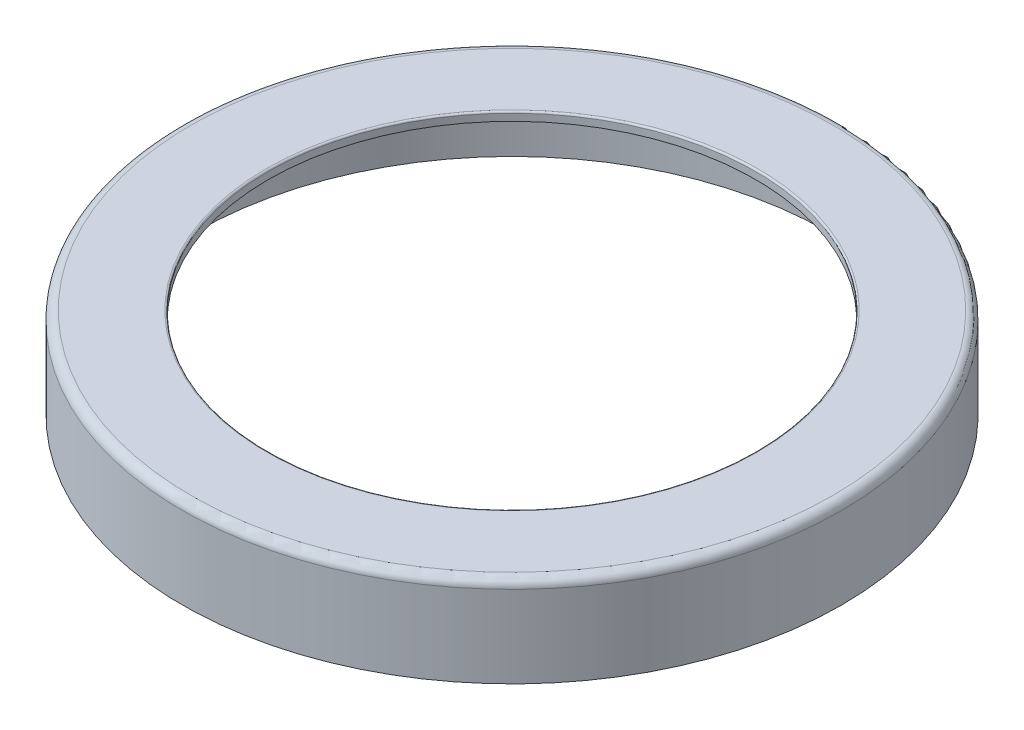
ISO-10303-21;
HEADER;
FILE_DESCRIPTION(('STEP AP214'),'2;1');
FILE_NAME('part.step','',(''),(''),'','','');
FILE_SCHEMA(('AUTOMOTIVE_DESIGN { 1 0 10303 214 1 1 1 1 }'));
ENDSEC;
DATA;
#1=APPLICATION_CONTEXT('core data for automotive mechanical design processes');
#2=APPLICATION_PROTOCOL_DEFINITION('international standard','automotive_design',2000,#1);
#3=PRODUCT_CONTEXT('',#1,'mechanical');
#4=PRODUCT('Part','Part','',(#3));
#5=PRODUCT_RELATED_PRODUCT_CATEGORY('part','',(#4));
#6=PRODUCT_DEFINITION_FORMATION('','',#4);
#7=PRODUCT_DEFINITION_CONTEXT('part definition',#1,'design');
#8=PRODUCT_DEFINITION('design','',#6,#7);
#9=PRODUCT_DEFINITION_SHAPE('','',#8);
#10=(LENGTH_UNIT() NAMED_UNIT(*) SI_UNIT(.MILLI.,.METRE.));
#11=(NAMED_UNIT(*) PLANE_ANGLE_UNIT() SI_UNIT($,.RADIAN.));
#12=(NAMED_UNIT(*) SI_UNIT($,.STERADIAN.) SOLID_ANGLE_UNIT());
#13=UNCERTAINTY_MEASURE_WITH_UNIT(LENGTH_MEASURE(1.E-05),#10,'distance_accuracy_value','');
#14=(GEOMETRIC_REPRESENTATION_CONTEXT(3) GLOBAL_UNCERTAINTY_ASSIGNED_CONTEXT((#13)) GLOBAL_UNIT_ASSIGNED_CONTEXT((#10,
#11,#12)) REPRESENTATION_CONTEXT('',''));
#15=CARTESIAN_POINT('',(0.,0.,0.));
#16=DIRECTION('',(0.,0.,1.));
#17=DIRECTION('',(1.,0.,0.));
#18=AXIS2_PLACEMENT_3D('',#15,#16,#17);
#19=CARTESIAN_POINT('',(-72.7,-1.,0.));
#20=DIRECTION('',(0.,1.,0.));
#21=DIRECTION('',(-1.,0.,0.));
#22=AXIS2_PLACEMENT_3D('',#19,#20,#21);
#23=PLANE('',#22);
#24=CARTESIAN_POINT('',(0.,-1.,0.));
#25=DIRECTION('',(0.,-1.,0.));
#26=DIRECTION('',(1.,0.,0.));
#27=AXIS2_PLACEMENT_3D('',#24,#25,#26);
#28=CIRCLE('',#27,72.7);
#29=CARTESIAN_POINT('',(72.7,-1.,0.));
#30=VERTEX_POINT('',#29);
#31=EDGE_CURVE('E10',#30,#30,#28,.T.);
#32=ORIENTED_EDGE('',*,*,#31,.F.);
#33=EDGE_LOOP('',(#32));
#34=FACE_BOUND('',#33,.T.);
#35=CARTESIAN_POINT('',(0.,-1.,0.));
#36=DIRECTION('',(0.,-1.,0.));
#37=DIRECTION('',(1.,0.,0.));
#38=AXIS2_PLACEMENT_3D('',#35,#36,#37);
#39=CIRCLE('',#38,75.7);
#40=CARTESIAN_POINT('',(75.7,-1.,0.));
#41=VERTEX_POINT('',#40);
#42=EDGE_CURVE('E78',#41,#41,#39,.T.);
#43=ORIENTED_EDGE('',*,*,#42,.T.);
#44=EDGE_LOOP('',(#43));
#45=FACE_BOUND('',#44,.T.);
#46=ADVANCED_FACE('F35',(#34,#45),#23,.F.);
#47=CARTESIAN_POINT('',(0.,0.,0.));
#48=DIRECTION('',(0.,-1.,0.));
#49=DIRECTION('',(1.,0.,0.));
#50=AXIS2_PLACEMENT_3D('',#47,#48,#49);
#51=CYLINDRICAL_SURFACE('',#50,72.7);
#52=CARTESIAN_POINT('',(0.,15.8,0.));
#53=DIRECTION('',(0.,-1.,0.));
#54=DIRECTION('',(1.,0.,0.));
#55=AXIS2_PLACEMENT_3D('',#52,#53,#54);
#56=CIRCLE('',#55,72.7);
#57=CARTESIAN_POINT('',(72.7,15.8,0.));
#58=VERTEX_POINT('',#57);
#59=EDGE_CURVE('E41',#58,#58,#56,.T.);
#60=ORIENTED_EDGE('',*,*,#59,.F.);
#61=EDGE_LOOP('',(#60));
#62=FACE_BOUND('',#61,.T.);
#63=ORIENTED_EDGE('',*,*,#31,.T.);
#64=EDGE_LOOP('',(#63));
#65=FACE_BOUND('',#64,.T.);
#66=ADVANCED_FACE('F145',(#62,#65),#51,.F.);
#67=CARTESIAN_POINT('',(0.,15.8,0.));
#68=DIRECTION('',(0.,-1.,0.));
#69=DIRECTION('',(1.,0.,0.));
#70=AXIS2_PLACEMENT_3D('',#67,#68,#69);
#71=TOROIDAL_SURFACE('',#70,70.7,2.);
#72=CARTESIAN_POINT('',(0.,17.8,0.));
#73=DIRECTION('',(0.,-1.,0.));
#74=DIRECTION('',(1.,0.,0.));
#75=AXIS2_PLACEMENT_3D('',#72,#73,#74);
#76=CIRCLE('',#75,70.7);
#77=CARTESIAN_POINT('',(70.7,17.8,0.));
#78=VERTEX_POINT('',#77);
#79=EDGE_CURVE('E45',#78,#78,#76,.T.);
#80=ORIENTED_EDGE('',*,*,#79,.F.);
#81=EDGE_LOOP('',(#80));
#82=FACE_BOUND('',#81,.T.);
#83=ORIENTED_EDGE('',*,*,#59,.T.);
#84=EDGE_LOOP('',(#83));
#85=FACE_BOUND('',#84,.T.);
#86=ADVANCED_FACE('F140',(#82,#85),#71,.F.);
#87=CARTESIAN_POINT('',(-70.7,17.8,0.));
#88=DIRECTION('',(0.,1.,0.));
#89=DIRECTION('',(-1.,0.,0.));
#90=AXIS2_PLACEMENT_3D('',#87,#88,#89);
#91=PLANE('',#90);
#92=CARTESIAN_POINT('',(0.,17.8,0.));
#93=DIRECTION('',(0.,-1.,0.));
#94=DIRECTION('',(1.,0.,0.));
#95=AXIS2_PLACEMENT_3D('',#92,#93,#94);
#96=CIRCLE('',#95,63.2);
#97=CARTESIAN_POINT('',(63.2,17.8,0.));
#98=VERTEX_POINT('',#97);
#99=EDGE_CURVE('E49',#98,#98,#96,.T.);
#100=ORIENTED_EDGE('',*,*,#99,.F.);
#101=EDGE_LOOP('',(#100));
#102=FACE_BOUND('',#101,.T.);
#103=ORIENTED_EDGE('',*,*,#79,.T.);
#104=EDGE_LOOP('',(#103));
#105=FACE_BOUND('',#104,.T.);
#106=ADVANCED_FACE('F134',(#102,#105),#91,.F.);
#107=CARTESIAN_POINT('',(0.,0.,0.));
#108=DIRECTION('',(0.,-1.,0.));
#109=DIRECTION('',(1.,0.,0.));
#110=AXIS2_PLACEMENT_3D('',#107,#108,#109);
#111=CYLINDRICAL_SURFACE('',#110,63.2);
#112=CARTESIAN_POINT('',(0.,16.4,0.));
#113=DIRECTION('',(0.,-1.,0.));
#114=DIRECTION('',(1.,0.,0.));
#115=AXIS2_PLACEMENT_3D('',#112,#113,#114);
#116=CIRCLE('',#115,63.2);
#117=CARTESIAN_POINT('',(63.2,16.4,0.));
#118=VERTEX_POINT('',#117);
#119=EDGE_CURVE('E54',#118,#118,#116,.T.);
#120=ORIENTED_EDGE('',*,*,#119,.F.);
#121=EDGE_LOOP('',(#120));
#122=FACE_BOUND('',#121,.T.);
#123=ORIENTED_EDGE('',*,*,#99,.T.);
#124=EDGE_LOOP('',(#123));
#125=FACE_BOUND('',#124,.T.);
#126=ADVANCED_FACE('F128',(#122,#125),#111,.T.);
#127=CARTESIAN_POINT('',(-61.2,16.4,0.));
#128=DIRECTION('',(0.,1.,0.));
#129=DIRECTION('',(-1.,0.,0.));
#130=AXIS2_PLACEMENT_3D('',#127,#128,#129);
#131=PLANE('',#130);
#132=CARTESIAN_POINT('',(0.,16.4,0.));
#133=DIRECTION('',(0.,-1.,0.));
#134=DIRECTION('',(1.,0.,0.));
#135=AXIS2_PLACEMENT_3D('',#132,#133,#134);
#136=CIRCLE('',#135,61.2);
#137=CARTESIAN_POINT('',(61.2,16.4,0.));
#138=VERTEX_POINT('',#137);
#139=EDGE_CURVE('E57',#138,#138,#136,.T.);
#140=ORIENTED_EDGE('',*,*,#139,.F.);
#141=EDGE_LOOP('',(#140));
#142=FACE_BOUND('',#141,.T.);
#143=ORIENTED_EDGE('',*,*,#119,.T.);
#144=EDGE_LOOP('',(#143));
#145=FACE_BOUND('',#144,.T.);
#146=ADVANCED_FACE('F122',(#142,#145),#131,.F.);
#147=CARTESIAN_POINT('',(0.,0.,0.));
#148=DIRECTION('',(0.,-1.,0.));
#149=DIRECTION('',(1.,0.,0.));
#150=AXIS2_PLACEMENT_3D('',#147,#148,#149);
#151=CYLINDRICAL_SURFACE('',#150,61.2);
#152=CARTESIAN_POINT('',(0.,17.8,0.));
#153=DIRECTION('',(0.,-1.,0.));
#154=DIRECTION('',(1.,0.,0.));
#155=AXIS2_PLACEMENT_3D('',#152,#153,#154);
#156=CIRCLE('',#155,61.2);
#157=CARTESIAN_POINT('',(61.2,17.8,0.));
#158=VERTEX_POINT('',#157);
#159=EDGE_CURVE('E60',#158,#158,#156,.T.);
#160=ORIENTED_EDGE('',*,*,#159,.F.);
#161=EDGE_LOOP('',(#160));
#162=FACE_BOUND('',#161,.T.);
#163=ORIENTED_EDGE('',*,*,#139,.T.);
#164=EDGE_LOOP('',(#163));
#165=FACE_BOUND('',#164,.T.);
#166=ADVANCED_FACE('F116',(#162,#165),#151,.F.);
#167=CARTESIAN_POINT('',(-61.2,17.8,0.));
#168=DIRECTION('',(0.,1.,0.));
#169=DIRECTION('',(-1.,0.,0.));
#170=AXIS2_PLACEMENT_3D('',#167,#168,#169);
#171=PLANE('',#170);
#172=CARTESIAN_POINT('',(0.,17.8,0.));
#173=DIRECTION('',(0.,-1.,0.));
#174=DIRECTION('',(1.,0.,0.));
#175=AXIS2_PLACEMENT_3D('',#172,#173,#174);
#176=CIRCLE('',#175,56.);
#177=CARTESIAN_POINT('',(56.,17.8,0.));
#178=VERTEX_POINT('',#177);
#179=EDGE_CURVE('E63',#178,#178,#176,.T.);
#180=ORIENTED_EDGE('',*,*,#179,.F.);
#181=EDGE_LOOP('',(#180));
#182=FACE_BOUND('',#181,.T.);
#183=ORIENTED_EDGE('',*,*,#159,.T.);
#184=EDGE_LOOP('',(#183));
#185=FACE_BOUND('',#184,.T.);
#186=ADVANCED_FACE('F110',(#182,#185),#171,.F.);
#187=CARTESIAN_POINT('',(0.,0.,0.));
#188=DIRECTION('',(0.,-1.,0.));
#189=DIRECTION('',(1.,0.,0.));
#190=AXIS2_PLACEMENT_3D('',#187,#188,#189);
#191=CYLINDRICAL_SURFACE('',#190,56.);
#192=CARTESIAN_POINT('',(0.,19.4,0.));
#193=DIRECTION('',(0.,-1.,0.));
#194=DIRECTION('',(1.,0.,0.));
#195=AXIS2_PLACEMENT_3D('',#192,#193,#194);
#196=CIRCLE('',#195,56.);
#197=CARTESIAN_POINT('',(56.,19.4,0.));
#198=VERTEX_POINT('',#197);
#199=EDGE_CURVE('E66',#198,#198,#196,.T.);
#200=ORIENTED_EDGE('',*,*,#199,.F.);
#201=EDGE_LOOP('',(#200));
#202=FACE_BOUND('',#201,.T.);
#203=ORIENTED_EDGE('',*,*,#179,.T.);
#204=EDGE_LOOP('',(#203));
#205=FACE_BOUND('',#204,.T.);
#206=ADVANCED_FACE('F104',(#202,#205),#191,.F.);
#207=CARTESIAN_POINT('',(0.,19.4,0.));
#208=DIRECTION('',(0.,-1.,0.));
#209=DIRECTION('',(1.,0.,0.));
#210=AXIS2_PLACEMENT_3D('',#207,#208,#209);
#211=TOROIDAL_SURFACE('',#210,56.4,0.399999999999999);
#212=CARTESIAN_POINT('',(0.,19.8,0.));
#213=DIRECTION('',(0.,-1.,0.));
#214=DIRECTION('',(1.,0.,0.));
#215=AXIS2_PLACEMENT_3D('',#212,#213,#214);
#216=CIRCLE('',#215,56.4);
#217=CARTESIAN_POINT('',(56.4,19.8,0.));
#218=VERTEX_POINT('',#217);
#219=EDGE_CURVE('E69',#218,#218,#216,.T.);
#220=ORIENTED_EDGE('',*,*,#219,.F.);
#221=EDGE_LOOP('',(#220));
#222=FACE_BOUND('',#221,.T.);
#223=ORIENTED_EDGE('',*,*,#199,.T.);
#224=EDGE_LOOP('',(#223));
#225=FACE_BOUND('',#224,.T.);
#226=ADVANCED_FACE('F98',(#222,#225),#211,.T.);
#227=CARTESIAN_POINT('',(-56.4,19.8,0.));
#228=DIRECTION('',(0.,-1.,0.));
#229=DIRECTION('',(1.,0.,0.));
#230=AXIS2_PLACEMENT_3D('',#227,#228,#229);
#231=PLANE('',#230);
#232=CARTESIAN_POINT('',(0.,19.8,0.));
#233=DIRECTION('',(0.,-1.,0.));
#234=DIRECTION('',(1.,0.,0.));
#235=AXIS2_PLACEMENT_3D('',#232,#233,#234);
#236=CIRCLE('',#235,73.7);
#237=CARTESIAN_POINT('',(73.7,19.8,0.));
#238=VERTEX_POINT('',#237);
#239=EDGE_CURVE('E72',#238,#238,#236,.T.);
#240=ORIENTED_EDGE('',*,*,#239,.F.);
#241=EDGE_LOOP('',(#240));
#242=FACE_BOUND('',#241,.T.);
#243=ORIENTED_EDGE('',*,*,#219,.T.);
#244=EDGE_LOOP('',(#243));
#245=FACE_BOUND('',#244,.T.);
#246=ADVANCED_FACE('F92',(#242,#245),#231,.F.);
#247=CARTESIAN_POINT('',(0.,17.8,0.));
#248=DIRECTION('',(0.,-1.,0.));
#249=DIRECTION('',(1.,0.,0.));
#250=AXIS2_PLACEMENT_3D('',#247,#248,#249);
#251=TOROIDAL_SURFACE('',#250,73.7,2.);
#252=CARTESIAN_POINT('',(0.,17.8,0.));
#253=DIRECTION('',(0.,-1.,0.));
#254=DIRECTION('',(1.,0.,0.));
#255=AXIS2_PLACEMENT_3D('',#252,#253,#254);
#256=CIRCLE('',#255,75.7);
#257=CARTESIAN_POINT('',(75.7,17.8,0.));
#258=VERTEX_POINT('',#257);
#259=EDGE_CURVE('E75',#258,#258,#256,.T.);
#260=ORIENTED_EDGE('',*,*,#259,.F.);
#261=EDGE_LOOP('',(#260));
#262=FACE_BOUND('',#261,.T.);
#263=ORIENTED_EDGE('',*,*,#239,.T.);
#264=EDGE_LOOP('',(#263));
#265=FACE_BOUND('',#264,.T.);
#266=ADVANCED_FACE('F86',(#262,#265),#251,.T.);
#267=CARTESIAN_POINT('',(0.,0.,0.));
#268=DIRECTION('',(0.,-1.,0.));
#269=DIRECTION('',(1.,0.,0.));
#270=AXIS2_PLACEMENT_3D('',#267,#268,#269);
#271=CYLINDRICAL_SURFACE('',#270,75.7);
#272=ORIENTED_EDGE('',*,*,#42,.F.);
#273=EDGE_LOOP('',(#272));
#274=FACE_BOUND('',#273,.T.);
#275=ORIENTED_EDGE('',*,*,#259,.T.);
#276=EDGE_LOOP('',(#275));
#277=FACE_BOUND('',#276,.T.);
#278=ADVANCED_FACE('F83',(#274,#277),#271,.T.);
#279=CLOSED_SHELL('',(#46,#66,#86,#106,#126,#146,#166,#186,#206,#226,#246,#266,#278));
#280=MANIFOLD_SOLID_BREP('B2',#279);
#281=ADVANCED_BREP_SHAPE_REPRESENTATION('',(#18,#280),#14);
#282=SHAPE_DEFINITION_REPRESENTATION(#9,#281);
ENDSEC;
END-ISO-10303-21;
